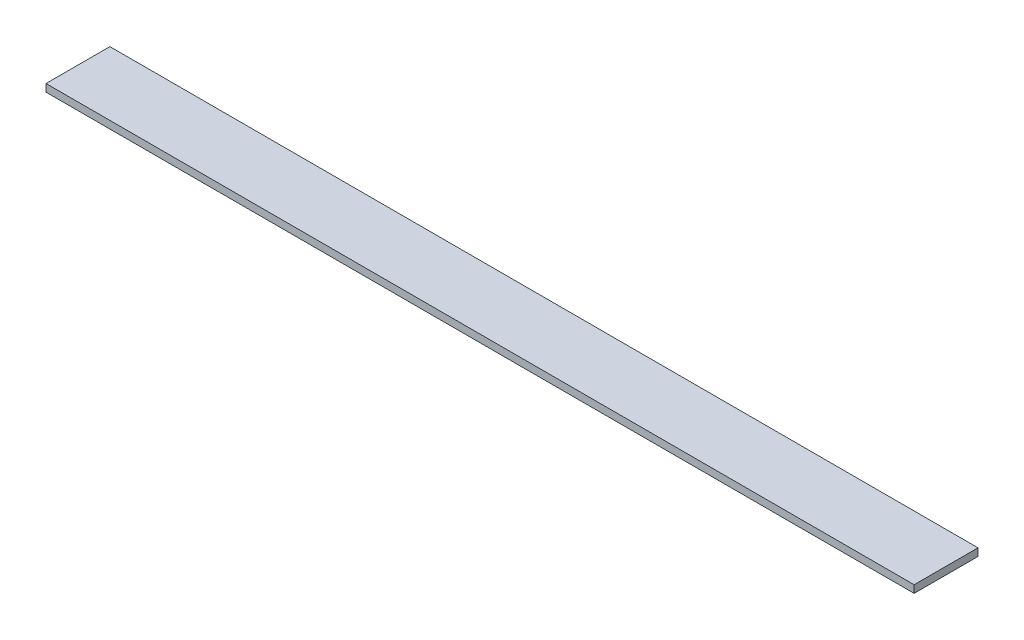
ISO-10303-21;
HEADER;
FILE_DESCRIPTION(('STEP AP214'),'2;1');
FILE_NAME('part.step','',(''),(''),'','','');
FILE_SCHEMA(('AUTOMOTIVE_DESIGN { 1 0 10303 214 1 1 1 1 }'));
ENDSEC;
DATA;
#1=APPLICATION_CONTEXT('core data for automotive mechanical design processes');
#2=APPLICATION_PROTOCOL_DEFINITION('international standard','automotive_design',2000,#1);
#3=PRODUCT_CONTEXT('',#1,'mechanical');
#4=PRODUCT('Part','Part','',(#3));
#5=PRODUCT_RELATED_PRODUCT_CATEGORY('part','',(#4));
#6=PRODUCT_DEFINITION_FORMATION('','',#4);
#7=PRODUCT_DEFINITION_CONTEXT('part definition',#1,'design');
#8=PRODUCT_DEFINITION('design','',#6,#7);
#9=PRODUCT_DEFINITION_SHAPE('','',#8);
#10=(LENGTH_UNIT() NAMED_UNIT(*) SI_UNIT(.MILLI.,.METRE.));
#11=(NAMED_UNIT(*) PLANE_ANGLE_UNIT() SI_UNIT($,.RADIAN.));
#12=(NAMED_UNIT(*) SI_UNIT($,.STERADIAN.) SOLID_ANGLE_UNIT());
#13=UNCERTAINTY_MEASURE_WITH_UNIT(LENGTH_MEASURE(1.E-05),#10,'distance_accuracy_value','');
#14=(GEOMETRIC_REPRESENTATION_CONTEXT(3) GLOBAL_UNCERTAINTY_ASSIGNED_CONTEXT((#13)) GLOBAL_UNIT_ASSIGNED_CONTEXT((#10,
#11,#12)) REPRESENTATION_CONTEXT('',''));
#15=CARTESIAN_POINT('',(0.,0.,0.));
#16=DIRECTION('',(0.,0.,1.));
#17=DIRECTION('',(1.,0.,0.));
#18=AXIS2_PLACEMENT_3D('',#15,#16,#17);
#19=CARTESIAN_POINT('',(0.,-1.,0.));
#20=DIRECTION('',(-1.,0.,0.));
#21=DIRECTION('',(0.,0.,1.));
#22=AXIS2_PLACEMENT_3D('',#19,#20,#21);
#23=PLANE('',#22);
#24=DIRECTION('',(0.,0.,1.));
#25=VECTOR('',#24,1.);
#26=CARTESIAN_POINT('',(0.,0.,0.));
#27=LINE('',#26,#25);
#28=CARTESIAN_POINT('',(0.,0.,0.));
#29=VERTEX_POINT('',#28);
#30=CARTESIAN_POINT('',(0.,0.,8.5));
#31=VERTEX_POINT('',#30);
#32=EDGE_CURVE('E98',#29,#31,#27,.T.);
#33=ORIENTED_EDGE('',*,*,#32,.F.);
#34=DIRECTION('',(0.,1.,0.));
#35=VECTOR('',#34,1.);
#36=CARTESIAN_POINT('',(0.,-1.,0.));
#37=LINE('',#36,#35);
#38=CARTESIAN_POINT('',(0.,-1.,0.));
#39=VERTEX_POINT('',#38);
#40=EDGE_CURVE('E11',#39,#29,#37,.T.);
#41=ORIENTED_EDGE('',*,*,#40,.F.);
#42=DIRECTION('',(0.,0.,1.));
#43=VECTOR('',#42,1.);
#44=CARTESIAN_POINT('',(0.,-1.,0.));
#45=LINE('',#44,#43);
#46=CARTESIAN_POINT('',(0.,-1.,8.5));
#47=VERTEX_POINT('',#46);
#48=EDGE_CURVE('E92',#39,#47,#45,.T.);
#49=ORIENTED_EDGE('',*,*,#48,.T.);
#50=DIRECTION('',(0.,1.,0.));
#51=VECTOR('',#50,1.);
#52=CARTESIAN_POINT('',(0.,-1.,8.5));
#53=LINE('',#52,#51);
#54=EDGE_CURVE('E37',#47,#31,#53,.T.);
#55=ORIENTED_EDGE('',*,*,#54,.T.);
#56=EDGE_LOOP('',(#33,#41,#49,#55));
#57=FACE_BOUND('',#56,.T.);
#58=ADVANCED_FACE('F34',(#57),#23,.T.);
#59=CARTESIAN_POINT('',(0.,-1.,0.));
#60=DIRECTION('',(0.,0.,-1.));
#61=DIRECTION('',(-1.,0.,0.));
#62=AXIS2_PLACEMENT_3D('',#59,#60,#61);
#63=PLANE('',#62);
#64=DIRECTION('',(-1.,0.,0.));
#65=VECTOR('',#64,1.);
#66=CARTESIAN_POINT('',(0.,0.,0.));
#67=LINE('',#66,#65);
#68=CARTESIAN_POINT('',(115.5,0.,0.));
#69=VERTEX_POINT('',#68);
#70=EDGE_CURVE('E94',#69,#29,#67,.T.);
#71=ORIENTED_EDGE('',*,*,#70,.F.);
#72=DIRECTION('',(0.,1.,0.));
#73=VECTOR('',#72,1.);
#74=CARTESIAN_POINT('',(115.5,-1.,0.));
#75=LINE('',#74,#73);
#76=CARTESIAN_POINT('',(115.5,-1.,0.));
#77=VERTEX_POINT('',#76);
#78=EDGE_CURVE('E43',#77,#69,#75,.T.);
#79=ORIENTED_EDGE('',*,*,#78,.F.);
#80=DIRECTION('',(-1.,0.,0.));
#81=VECTOR('',#80,1.);
#82=CARTESIAN_POINT('',(0.,-1.,0.));
#83=LINE('',#82,#81);
#84=EDGE_CURVE('E89',#77,#39,#83,.T.);
#85=ORIENTED_EDGE('',*,*,#84,.T.);
#86=ORIENTED_EDGE('',*,*,#40,.T.);
#87=EDGE_LOOP('',(#71,#79,#85,#86));
#88=FACE_BOUND('',#87,.T.);
#89=ADVANCED_FACE('F108',(#88),#63,.T.);
#90=CARTESIAN_POINT('',(115.5,-1.,0.));
#91=DIRECTION('',(1.,0.,0.));
#92=DIRECTION('',(0.,0.,-1.));
#93=AXIS2_PLACEMENT_3D('',#90,#91,#92);
#94=PLANE('',#93);
#95=DIRECTION('',(0.,0.,-1.));
#96=VECTOR('',#95,1.);
#97=CARTESIAN_POINT('',(115.5,0.,0.));
#98=LINE('',#97,#96);
#99=CARTESIAN_POINT('',(115.5,0.,8.5));
#100=VERTEX_POINT('',#99);
#101=EDGE_CURVE('E84',#100,#69,#98,.T.);
#102=ORIENTED_EDGE('',*,*,#101,.F.);
#103=DIRECTION('',(0.,1.,0.));
#104=VECTOR('',#103,1.);
#105=CARTESIAN_POINT('',(115.5,-1.,8.5));
#106=LINE('',#105,#104);
#107=CARTESIAN_POINT('',(115.5,-1.,8.5));
#108=VERTEX_POINT('',#107);
#109=EDGE_CURVE('E79',#108,#100,#106,.T.);
#110=ORIENTED_EDGE('',*,*,#109,.F.);
#111=DIRECTION('',(0.,0.,-1.));
#112=VECTOR('',#111,1.);
#113=CARTESIAN_POINT('',(115.5,-1.,0.));
#114=LINE('',#113,#112);
#115=EDGE_CURVE('E82',#108,#77,#114,.T.);
#116=ORIENTED_EDGE('',*,*,#115,.T.);
#117=ORIENTED_EDGE('',*,*,#78,.T.);
#118=EDGE_LOOP('',(#102,#110,#116,#117));
#119=FACE_BOUND('',#118,.T.);
#120=ADVANCED_FACE('F81',(#119),#94,.T.);
#121=CARTESIAN_POINT('',(0.,-1.,8.5));
#122=DIRECTION('',(0.,0.,1.));
#123=DIRECTION('',(1.,0.,0.));
#124=AXIS2_PLACEMENT_3D('',#121,#122,#123);
#125=PLANE('',#124);
#126=DIRECTION('',(1.,0.,0.));
#127=VECTOR('',#126,1.);
#128=CARTESIAN_POINT('',(0.,0.,8.5));
#129=LINE('',#128,#127);
#130=EDGE_CURVE('E101',#31,#100,#129,.T.);
#131=ORIENTED_EDGE('',*,*,#130,.F.);
#132=ORIENTED_EDGE('',*,*,#54,.F.);
#133=DIRECTION('',(1.,0.,0.));
#134=VECTOR('',#133,1.);
#135=CARTESIAN_POINT('',(0.,-1.,8.5));
#136=LINE('',#135,#134);
#137=EDGE_CURVE('E88',#47,#108,#136,.T.);
#138=ORIENTED_EDGE('',*,*,#137,.T.);
#139=ORIENTED_EDGE('',*,*,#109,.T.);
#140=EDGE_LOOP('',(#131,#132,#138,#139));
#141=FACE_BOUND('',#140,.T.);
#142=ADVANCED_FACE('F91',(#141),#125,.T.);
#143=CARTESIAN_POINT('',(0.,-1.,0.));
#144=DIRECTION('',(0.,1.,0.));
#145=DIRECTION('',(0.,0.,1.));
#146=AXIS2_PLACEMENT_3D('',#143,#144,#145);
#147=PLANE('',#146);
#148=ORIENTED_EDGE('',*,*,#48,.F.);
#149=ORIENTED_EDGE('',*,*,#84,.F.);
#150=ORIENTED_EDGE('',*,*,#115,.F.);
#151=ORIENTED_EDGE('',*,*,#137,.F.);
#152=EDGE_LOOP('',(#148,#149,#150,#151));
#153=FACE_BOUND('',#152,.T.);
#154=ADVANCED_FACE('F87',(#153),#147,.F.);
#155=CARTESIAN_POINT('',(0.,0.,0.));
#156=DIRECTION('',(0.,1.,0.));
#157=DIRECTION('',(0.,0.,1.));
#158=AXIS2_PLACEMENT_3D('',#155,#156,#157);
#159=PLANE('',#158);
#160=ORIENTED_EDGE('',*,*,#32,.T.);
#161=ORIENTED_EDGE('',*,*,#130,.T.);
#162=ORIENTED_EDGE('',*,*,#101,.T.);
#163=ORIENTED_EDGE('',*,*,#70,.T.);
#164=EDGE_LOOP('',(#160,#161,#162,#163));
#165=FACE_BOUND('',#164,.T.);
#166=ADVANCED_FACE('F107',(#165),#159,.T.);
#167=CLOSED_SHELL('',(#58,#89,#120,#142,#154,#166));
#168=MANIFOLD_SOLID_BREP('B2',#167);
#169=ADVANCED_BREP_SHAPE_REPRESENTATION('',(#18,#168),#14);
#170=SHAPE_DEFINITION_REPRESENTATION(#9,#169);
ENDSEC;
END-ISO-10303-21;
